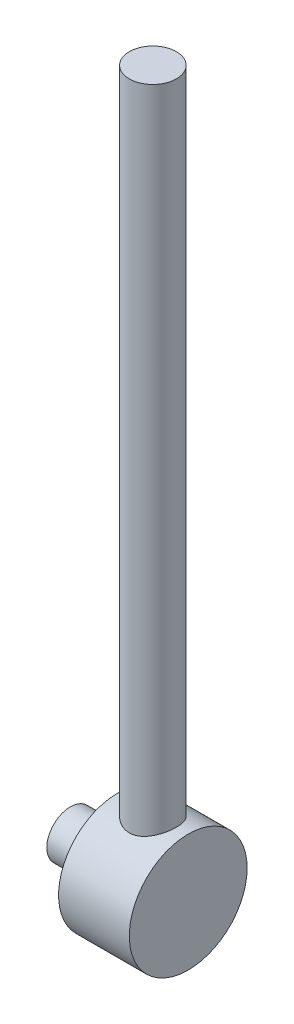
ISO-10303-21;
HEADER;
FILE_DESCRIPTION(('STEP AP214'),'2;1');
FILE_NAME('part.step','',(''),(''),'','','');
FILE_SCHEMA(('AUTOMOTIVE_DESIGN { 1 0 10303 214 1 1 1 1 }'));
ENDSEC;
DATA;
#1=APPLICATION_CONTEXT('core data for automotive mechanical design processes');
#2=APPLICATION_PROTOCOL_DEFINITION('international standard','automotive_design',2000,#1);
#3=PRODUCT_CONTEXT('',#1,'mechanical');
#4=PRODUCT('Part','Part','',(#3));
#5=PRODUCT_RELATED_PRODUCT_CATEGORY('part','',(#4));
#6=PRODUCT_DEFINITION_FORMATION('','',#4);
#7=PRODUCT_DEFINITION_CONTEXT('part definition',#1,'design');
#8=PRODUCT_DEFINITION('design','',#6,#7);
#9=PRODUCT_DEFINITION_SHAPE('','',#8);
#10=(LENGTH_UNIT() NAMED_UNIT(*) SI_UNIT(.MILLI.,.METRE.));
#11=(NAMED_UNIT(*) PLANE_ANGLE_UNIT() SI_UNIT($,.RADIAN.));
#12=(NAMED_UNIT(*) SI_UNIT($,.STERADIAN.) SOLID_ANGLE_UNIT());
#13=UNCERTAINTY_MEASURE_WITH_UNIT(LENGTH_MEASURE(1.E-05),#10,'distance_accuracy_value','');
#14=(GEOMETRIC_REPRESENTATION_CONTEXT(3) GLOBAL_UNCERTAINTY_ASSIGNED_CONTEXT((#13)) GLOBAL_UNIT_ASSIGNED_CONTEXT((#10,
#11,#12)) REPRESENTATION_CONTEXT('',''));
#15=CARTESIAN_POINT('',(0.,0.,0.));
#16=DIRECTION('',(0.,0.,1.));
#17=DIRECTION('',(1.,0.,0.));
#18=AXIS2_PLACEMENT_3D('',#15,#16,#17);
#19=CARTESIAN_POINT('',(15.,0.,0.));
#20=DIRECTION('',(-1.,0.,0.));
#21=DIRECTION('',(0.,0.,1.));
#22=AXIS2_PLACEMENT_3D('',#19,#20,#21);
#23=CYLINDRICAL_SURFACE('',#22,12.5);
#24=CARTESIAN_POINT('',(7.5,11.4564392373896,5.));
#25=CARTESIAN_POINT('',(7.63397165524294,11.4564402717028,4.99999896345635));
#26=CARTESIAN_POINT('',(7.76798425872973,11.458797133836,4.99460812226169));
#27=CARTESIAN_POINT('',(8.03504068407364,11.468148782329,4.97309727860774));
#28=CARTESIAN_POINT('',(8.16808386256458,11.475146407354,4.9569707092876));
#29=CARTESIAN_POINT('',(8.43241788697739,11.4935628683181,4.91411809632373));
#30=CARTESIAN_POINT('',(8.56370469858677,11.5049905138317,4.88737092988402));
#31=CARTESIAN_POINT('',(8.82336715523419,11.5318953875125,4.82354498839359));
#32=CARTESIAN_POINT('',(8.95174156760431,11.5473742968604,4.78646192376799));
#33=CARTESIAN_POINT('',(9.20415322649276,11.581820925773,4.70249631279829));
#34=CARTESIAN_POINT('',(9.32820647864437,11.6007736592095,4.65565574627603));
#35=CARTESIAN_POINT('',(9.57181198153451,11.6416475565821,4.55248500137674));
#36=CARTESIAN_POINT('',(9.69136252124685,11.6635698346833,4.49615125924048));
#37=CARTESIAN_POINT('',(10.0420729039336,11.7328492963712,4.31360496151711));
#38=CARTESIAN_POINT('',(10.2656063546124,11.7837645418909,4.17374176623427));
#39=CARTESIAN_POINT('',(10.6981857888427,11.8925250245327,3.85329894815134));
#40=CARTESIAN_POINT('',(10.9058792065433,11.9505927192206,3.67098388496263));
#41=CARTESIAN_POINT('',(11.288834348201,12.0653166560418,3.27423726141594));
#42=CARTESIAN_POINT('',(11.4640847386417,12.1219723989708,3.05979452486023));
#43=CARTESIAN_POINT('',(11.7021447855065,12.202547497669,2.7134344670967));
#44=CARTESIAN_POINT('',(11.7785660502037,12.2291337235759,2.59127330992831));
#45=CARTESIAN_POINT('',(11.9207773195049,12.279611145716,2.34040236484104));
#46=CARTESIAN_POINT('',(11.9865717050344,12.3035034512837,2.21169530438852));
#47=CARTESIAN_POINT('',(12.1069541674048,12.3479105610271,1.94856757348532));
#48=CARTESIAN_POINT('',(12.1615409135514,12.368424964084,1.81414622685608));
#49=CARTESIAN_POINT('',(12.2589396644702,12.4054615764431,1.54063330241623));
#50=CARTESIAN_POINT('',(12.3017574132066,12.421985732741,1.40154404015105));
#51=CARTESIAN_POINT('',(12.3734198299829,12.4498668714047,1.12649748730776));
#52=CARTESIAN_POINT('',(12.4028366387446,12.4614338373031,0.990710411787399));
#53=CARTESIAN_POINT('',(12.4502849114584,12.4801780649836,0.716918272307659));
#54=CARTESIAN_POINT('',(12.4683213577866,12.4873572477146,0.578914206131963));
#55=CARTESIAN_POINT('',(12.4928258913666,12.4971270279997,0.301736395081975));
#56=CARTESIAN_POINT('',(12.499295294407,12.4997181474605,0.162562785056854));
#57=CARTESIAN_POINT('',(12.5005955779033,12.5002382016647,-0.115845101070376));
#58=CARTESIAN_POINT('',(12.495426867525,12.4981673003126,-0.255079374867638));
#59=CARTESIAN_POINT('',(12.4741309016248,12.4896713712922,-0.524650869352971));
#60=CARTESIAN_POINT('',(12.4586385090055,12.4834986467002,-0.655046772976126));
#61=CARTESIAN_POINT('',(12.4174960679338,12.4672134509988,-0.914018496973078));
#62=CARTESIAN_POINT('',(12.3918426437638,12.4570996706023,-1.04259369775126));
#63=CARTESIAN_POINT('',(12.3306277816617,12.4331882180521,-1.29697225214547));
#64=CARTESIAN_POINT('',(12.2950696014092,12.4193917571961,-1.42277650247331));
#65=CARTESIAN_POINT('',(12.2143667172739,12.3884573859377,-1.67086551320143));
#66=CARTESIAN_POINT('',(12.1692183725694,12.3713182067042,-1.7931489168656));
#67=CARTESIAN_POINT('',(12.0184537551035,12.3149324325075,-2.15709786014183));
#68=CARTESIAN_POINT('',(11.8983903983692,12.2710725946817,-2.39225334748552));
#69=CARTESIAN_POINT('',(11.6238227922551,12.1753610452512,-2.83956110178507));
#70=CARTESIAN_POINT('',(11.4693067385417,12.1235065963813,-3.05170544744262));
#71=CARTESIAN_POINT('',(11.1183918434855,12.0130436045134,-3.46190518931431));
#72=CARTESIAN_POINT('',(10.9199092472455,11.9542151441502,-3.65812112197786));
#73=CARTESIAN_POINT('',(10.4924795773737,11.8390345406944,-4.01529203734465));
#74=CARTESIAN_POINT('',(10.2635225715202,11.7826832129484,-4.17623547858125));
#75=CARTESIAN_POINT('',(9.89802740948268,11.7040921301282,-4.38978443246195));
#76=CARTESIAN_POINT('',(9.77055782432058,11.6785690992132,-4.45706290689687));
#77=CARTESIAN_POINT('',(9.50981122078396,11.6306899868532,-4.58054965734117));
#78=CARTESIAN_POINT('',(9.37653658660871,11.6083326209757,-4.63676242676807));
#79=CARTESIAN_POINT('',(9.10512886687858,11.5675599040094,-4.73756451801146));
#80=CARTESIAN_POINT('',(8.96699733092773,11.5491433086618,-4.78215750962756));
#81=CARTESIAN_POINT('',(8.68687598635898,11.5169149498478,-4.8592612872628));
#82=CARTESIAN_POINT('',(8.54488648932526,11.5031028156954,-4.89177304591582));
#83=CARTESIAN_POINT('',(8.26697943771532,11.4813002098815,-4.94271833591524));
#84=CARTESIAN_POINT('',(8.13122083840416,11.4730056443021,-4.96189056112493));
#85=CARTESIAN_POINT('',(7.85838292642625,11.4612332927934,-4.98902318531047));
#86=CARTESIAN_POINT('',(7.72130369253642,11.4577552213259,-4.9969842489227));
#87=CARTESIAN_POINT('',(7.44695400378868,11.4557410341827,-5.00160011831507));
#88=CARTESIAN_POINT('',(7.30968360674379,11.4572036559226,-4.99825781264842));
#89=CARTESIAN_POINT('',(7.03602581706125,11.465014739381,-4.9803144219869));
#90=CARTESIAN_POINT('',(6.89963840224991,11.4713630779243,-4.96571362083305));
#91=CARTESIAN_POINT('',(6.63656879775067,11.4882237920049,-4.9265749164465));
#92=CARTESIAN_POINT('',(6.50977794809718,11.4984770141227,-4.90265366107081));
#93=CARTESIAN_POINT('',(6.25875618130735,11.5228053113983,-4.8451953366982));
#94=CARTESIAN_POINT('',(6.13452610678851,11.5368816236004,-4.81165515509086));
#95=CARTESIAN_POINT('',(5.76691774860361,11.5842454065119,-4.69704010843111));
#96=CARTESIAN_POINT('',(5.52841759906676,11.6226817971661,-4.60193998403524));
#97=CARTESIAN_POINT('',(5.06095323066635,11.7108466432683,-4.37282827873935));
#98=CARTESIAN_POINT('',(4.83276795684226,11.7609698182513,-4.23739510722872));
#99=CARTESIAN_POINT('',(4.40130910957724,11.8662574257747,-3.93292512945836));
#100=CARTESIAN_POINT('',(4.19804573606275,11.9214239063997,-3.76387463817205));
#101=CARTESIAN_POINT('',(3.80653918294178,12.0355301113653,-3.38207030815393));
#102=CARTESIAN_POINT('',(3.62051448988286,12.0944475552276,-3.16701066461656));
#103=CARTESIAN_POINT('',(3.3703992699822,12.1777434479098,-2.8225211988967));
#104=CARTESIAN_POINT('',(3.29181021620806,12.2046763459874,-2.70396535427571));
#105=CARTESIAN_POINT('',(3.14482567023649,12.2561332265696,-2.46021851983988));
#106=CARTESIAN_POINT('',(3.0764257973788,12.2806582427457,-2.33503041301595));
#107=CARTESIAN_POINT('',(2.95037400652796,12.3266236420592,-2.07877500253335));
#108=CARTESIAN_POINT('',(2.89272489123972,12.3480632204964,-1.94770617679832));
#109=CARTESIAN_POINT('',(2.78875156580794,12.3872330385287,-1.68067073132675));
#110=CARTESIAN_POINT('',(2.74242253771736,12.4049648557207,-1.5447062236131));
#111=CARTESIAN_POINT('',(2.66154855938966,12.4362060252013,-1.26887322258795));
#112=CARTESIAN_POINT('',(2.62700090324018,12.4497163470114,-1.12900563371974));
#113=CARTESIAN_POINT('',(2.57006306153231,12.4721125367424,-0.846455094767155));
#114=CARTESIAN_POINT('',(2.54767205405146,12.4809987173042,-0.703772335695226));
#115=CARTESIAN_POINT('',(2.51636921507362,12.4934537211406,-0.426189188874796));
#116=CARTESIAN_POINT('',(2.50667090218394,12.4973325728447,-0.29139084730892));
#117=CARTESIAN_POINT('',(2.49822057027812,12.5007112401544,-0.021347899460419));
#118=CARTESIAN_POINT('',(2.4994722390339,12.5002095804766,0.113896841832117));
#119=CARTESIAN_POINT('',(2.51291468621284,12.494838227668,0.383682371685983));
#120=CARTESIAN_POINT('',(2.52509979023168,12.4899708003515,0.518223488997533));
#121=CARTESIAN_POINT('',(2.56027688653836,12.4760011543377,0.78571069748368));
#122=CARTESIAN_POINT('',(2.58327290818406,12.4668973567075,0.918656174981794));
#123=CARTESIAN_POINT('',(2.63895924491565,12.4450424209029,1.17783467109343));
#124=CARTESIAN_POINT('',(2.67132510598137,12.4324137928292,1.30414775975408));
#125=CARTESIAN_POINT('',(2.74568388662941,12.4037235206992,1.55352320958305));
#126=CARTESIAN_POINT('',(2.7876801821611,12.3876606729109,1.6765844138923));
#127=CARTESIAN_POINT('',(2.92759290925032,12.3348836832436,2.03966746176945));
#128=CARTESIAN_POINT('',(3.03947967550367,12.2935620878725,2.27380285420272));
#129=CARTESIAN_POINT('',(3.30277202966874,12.2004490642966,2.73054850188528));
#130=CARTESIAN_POINT('',(3.4557054768922,12.1482756628413,2.95219224097235));
#131=CARTESIAN_POINT('',(3.79445655215535,12.0397376610957,3.36761879060515));
#132=CARTESIAN_POINT('',(3.98028779083935,11.9833713317038,3.56139000921306));
#133=CARTESIAN_POINT('',(4.39333579430966,11.868436623319,3.92802886630618));
#134=CARTESIAN_POINT('',(4.62240239738847,11.8099479390711,4.09885985592737));
#135=CARTESIAN_POINT('',(4.98611924607892,11.728408450531,4.324448364638));
#136=CARTESIAN_POINT('',(5.11079907463087,11.702245811434,4.39457064715659));
#137=CARTESIAN_POINT('',(5.36614704128715,11.652796822025,4.52406061529862));
#138=CARTESIAN_POINT('',(5.49681221921188,11.6295090704921,4.58343354679449));
#139=CARTESIAN_POINT('',(5.75134950386906,11.5885044900563,4.68607952471922));
#140=CARTESIAN_POINT('',(5.87478383776035,11.5704756811238,4.73031761912949));
#141=CARTESIAN_POINT('',(6.12512978867947,11.5379755486851,4.80904723188735));
#142=CARTESIAN_POINT('',(6.25203980034176,11.523502612576,4.84354316940793));
#143=CARTESIAN_POINT('',(6.50826978608844,11.4985783767202,4.90241942653943));
#144=CARTESIAN_POINT('',(6.63758375283873,11.4881181780282,4.92682213915176));
#145=CARTESIAN_POINT('',(6.89795369965913,11.4715127104981,4.96536414411407));
#146=CARTESIAN_POINT('',(7.02900862351641,11.4653649371894,4.97950939371721));
#147=CARTESIAN_POINT('',(7.21693769688889,11.4597961056739,4.99230265232103));
#148=CARTESIAN_POINT('',(7.27349962951827,11.4585382897539,4.99518816672682));
#149=CARTESIAN_POINT('',(7.38670526366435,11.4568596062454,4.9990371301843));
#150=CARTESIAN_POINT('',(7.44334897087165,11.4564388000217,5.00000043831111));
#151=CARTESIAN_POINT('',(7.5,11.4564392373896,5.));
#152=B_SPLINE_CURVE_WITH_KNOTS('',3,(#24,#25,#26,#27,#28,#29,#30,#31,#32,#33,#34,#35,#36,#37,
#38,#39,#40,#41,#42,#43,#44,#45,#46,#47,#48,#49,#50,#51,#52,#53,#54,#55,#56,#57,#58,#59,#60,#61,
#62,#63,#64,#65,#66,#67,#68,#69,#70,#71,#72,#73,#74,#75,#76,#77,#78,#79,#80,#81,#82,#83,#84,#85,
#86,#87,#88,#89,#90,#91,#92,#93,#94,#95,#96,#97,#98,#99,#100,#101,#102,#103,#104,#105,#106,#107,
#108,#109,#110,#111,#112,#113,#114,#115,#116,#117,#118,#119,#120,#121,#122,#123,#124,#125,#126,
#127,#128,#129,#130,#131,#132,#133,#134,#135,#136,#137,#138,#139,#140,#141,#142,#143,#144,#145,
#146,#147,#148,#149,#150,#151),.UNSPECIFIED.,.T.,.F.,(4,2,2,2,2,2,2,2,2,2,2,2,2,2,2,2,2,2,2,2,2,
2,2,2,2,2,2,2,2,2,2,2,2,2,2,2,2,2,2,2,2,2,2,2,2,2,2,2,2,2,2,2,2,2,2,2,2,2,2,2,2,2,2,4),(0.,
0.401857604173007,0.803961243888991,1.20686864636058,1.60994351192958,2.01131877198553,
2.41284504624413,3.21490370860719,4.05855844512127,4.90250734671921,5.34162944437914,
5.78057004956793,6.21956274051595,6.65834079517783,7.07605372410076,7.49358364921535,
7.91106607592916,8.3285338252766,8.7224433905093,9.11648393105507,9.5103950241715,
9.9044559303143,10.7036345579603,11.5030874255886,12.3550281541217,13.207247230266,
13.6459081564649,14.0843905878331,14.5227343678116,14.9610428500329,15.3725755678593,
15.7840838875773,16.1954870551217,16.6068798510072,16.9947241755283,17.3826941453685,
18.1580219095308,18.9647918095574,19.7718908063861,20.6386062994143,21.0724736227438,
21.5061538706741,21.9399470207648,22.3735552211117,22.8070637643667,23.2405429940499,
23.6456433748876,24.050880192055,24.4559068146868,24.8610845153934,25.2536349873096,
25.646323278747,26.4310478633778,27.2504496961613,28.0701913317683,28.9406797498035,
29.3764938523358,29.8120946932277,30.2087331024766,30.6051913011724,31.0007651307087,
31.3961090374152,31.5660254121741,31.735954243748),.UNSPECIFIED.);
#153=CARTESIAN_POINT('',(7.5,11.4564392373896,5.));
#154=VERTEX_POINT('',#153);
#155=EDGE_CURVE('E47',#154,#154,#152,.T.);
#156=ORIENTED_EDGE('',*,*,#155,.F.);
#157=EDGE_LOOP('',(#156));
#158=FACE_BOUND('',#157,.T.);
#159=CARTESIAN_POINT('',(15.,0.,0.));
#160=DIRECTION('',(1.,0.,0.));
#161=DIRECTION('',(0.,0.,-1.));
#162=AXIS2_PLACEMENT_3D('',#159,#160,#161);
#163=CIRCLE('',#162,12.5);
#164=CARTESIAN_POINT('',(15.,0.,-12.5));
#165=VERTEX_POINT('',#164);
#166=EDGE_CURVE('E10',#165,#165,#163,.T.);
#167=ORIENTED_EDGE('',*,*,#166,.F.);
#168=EDGE_LOOP('',(#167));
#169=FACE_BOUND('',#168,.T.);
#170=CARTESIAN_POINT('',(0.,0.,0.));
#171=DIRECTION('',(1.,0.,0.));
#172=DIRECTION('',(0.,0.,-1.));
#173=AXIS2_PLACEMENT_3D('',#170,#171,#172);
#174=CIRCLE('',#173,12.5);
#175=CARTESIAN_POINT('',(0.,0.,-12.5));
#176=VERTEX_POINT('',#175);
#177=EDGE_CURVE('E35',#176,#176,#174,.T.);
#178=ORIENTED_EDGE('',*,*,#177,.T.);
#179=EDGE_LOOP('',(#178));
#180=FACE_BOUND('',#179,.T.);
#181=ADVANCED_FACE('F32',(#158,#169,#180),#23,.T.);
#182=CARTESIAN_POINT('',(15.,0.,0.));
#183=DIRECTION('',(1.,0.,0.));
#184=DIRECTION('',(0.,0.,-1.));
#185=AXIS2_PLACEMENT_3D('',#182,#183,#184);
#186=PLANE('',#185);
#187=ORIENTED_EDGE('',*,*,#166,.T.);
#188=EDGE_LOOP('',(#187));
#189=FACE_BOUND('',#188,.T.);
#190=ADVANCED_FACE('F75',(#189),#186,.T.);
#191=CARTESIAN_POINT('',(0.,0.,0.));
#192=DIRECTION('',(1.,0.,0.));
#193=DIRECTION('',(0.,0.,-1.));
#194=AXIS2_PLACEMENT_3D('',#191,#192,#193);
#195=PLANE('',#194);
#196=CARTESIAN_POINT('',(0.,0.,0.));
#197=DIRECTION('',(1.,0.,0.));
#198=DIRECTION('',(0.,0.,-1.));
#199=AXIS2_PLACEMENT_3D('',#196,#197,#198);
#200=CIRCLE('',#199,5.);
#201=CARTESIAN_POINT('',(0.,0.,-5.));
#202=VERTEX_POINT('',#201);
#203=EDGE_CURVE('E44',#202,#202,#200,.T.);
#204=ORIENTED_EDGE('',*,*,#203,.T.);
#205=EDGE_LOOP('',(#204));
#206=FACE_BOUND('',#205,.T.);
#207=ORIENTED_EDGE('',*,*,#177,.F.);
#208=EDGE_LOOP('',(#207));
#209=FACE_BOUND('',#208,.T.);
#210=ADVANCED_FACE('F80',(#206,#209),#195,.F.);
#211=CARTESIAN_POINT('',(-10.,0.,0.));
#212=DIRECTION('',(1.,0.,0.));
#213=DIRECTION('',(0.,0.,-1.));
#214=AXIS2_PLACEMENT_3D('',#211,#212,#213);
#215=CYLINDRICAL_SURFACE('',#214,5.);
#216=CARTESIAN_POINT('',(-10.,0.,0.));
#217=DIRECTION('',(1.,0.,0.));
#218=DIRECTION('',(0.,0.,-1.));
#219=AXIS2_PLACEMENT_3D('',#216,#217,#218);
#220=CIRCLE('',#219,5.);
#221=CARTESIAN_POINT('',(-10.,0.,-5.));
#222=VERTEX_POINT('',#221);
#223=EDGE_CURVE('E42',#222,#222,#220,.T.);
#224=ORIENTED_EDGE('',*,*,#223,.T.);
#225=EDGE_LOOP('',(#224));
#226=FACE_BOUND('',#225,.T.);
#227=ORIENTED_EDGE('',*,*,#203,.F.);
#228=EDGE_LOOP('',(#227));
#229=FACE_BOUND('',#228,.T.);
#230=ADVANCED_FACE('F71',(#226,#229),#215,.T.);
#231=CARTESIAN_POINT('',(-10.,0.,0.));
#232=DIRECTION('',(1.,0.,0.));
#233=DIRECTION('',(0.,0.,-1.));
#234=AXIS2_PLACEMENT_3D('',#231,#232,#233);
#235=PLANE('',#234);
#236=ORIENTED_EDGE('',*,*,#223,.F.);
#237=EDGE_LOOP('',(#236));
#238=FACE_BOUND('',#237,.T.);
#239=ADVANCED_FACE('F64',(#238),#235,.F.);
#240=CARTESIAN_POINT('',(7.5,150.,0.));
#241=DIRECTION('',(0.,1.,0.));
#242=DIRECTION('',(0.,0.,1.));
#243=AXIS2_PLACEMENT_3D('',#240,#241,#242);
#244=PLANE('',#243);
#245=CARTESIAN_POINT('',(7.5,150.,0.));
#246=DIRECTION('',(0.,1.,0.));
#247=DIRECTION('',(0.,0.,1.));
#248=AXIS2_PLACEMENT_3D('',#245,#246,#247);
#249=CIRCLE('',#248,5.);
#250=CARTESIAN_POINT('',(7.5,150.,5.));
#251=VERTEX_POINT('',#250);
#252=EDGE_CURVE('E56',#251,#251,#249,.T.);
#253=ORIENTED_EDGE('',*,*,#252,.T.);
#254=EDGE_LOOP('',(#253));
#255=FACE_BOUND('',#254,.T.);
#256=ADVANCED_FACE('F62',(#255),#244,.T.);
#257=CARTESIAN_POINT('',(7.5,-12.501,0.));
#258=DIRECTION('',(0.,1.,0.));
#259=DIRECTION('',(0.,0.,1.));
#260=AXIS2_PLACEMENT_3D('',#257,#258,#259);
#261=CYLINDRICAL_SURFACE('',#260,5.);
#262=ORIENTED_EDGE('',*,*,#252,.F.);
#263=EDGE_LOOP('',(#262));
#264=FACE_BOUND('',#263,.T.);
#265=ORIENTED_EDGE('',*,*,#155,.T.);
#266=EDGE_LOOP('',(#265));
#267=FACE_BOUND('',#266,.T.);
#268=ADVANCED_FACE('F57',(#264,#267),#261,.T.);
#269=CLOSED_SHELL('',(#181,#190,#210,#230,#239,#256,#268));
#270=MANIFOLD_SOLID_BREP('B2',#269);
#271=ADVANCED_BREP_SHAPE_REPRESENTATION('',(#18,#270),#14);
#272=SHAPE_DEFINITION_REPRESENTATION(#9,#271);
ENDSEC;
END-ISO-10303-21;
